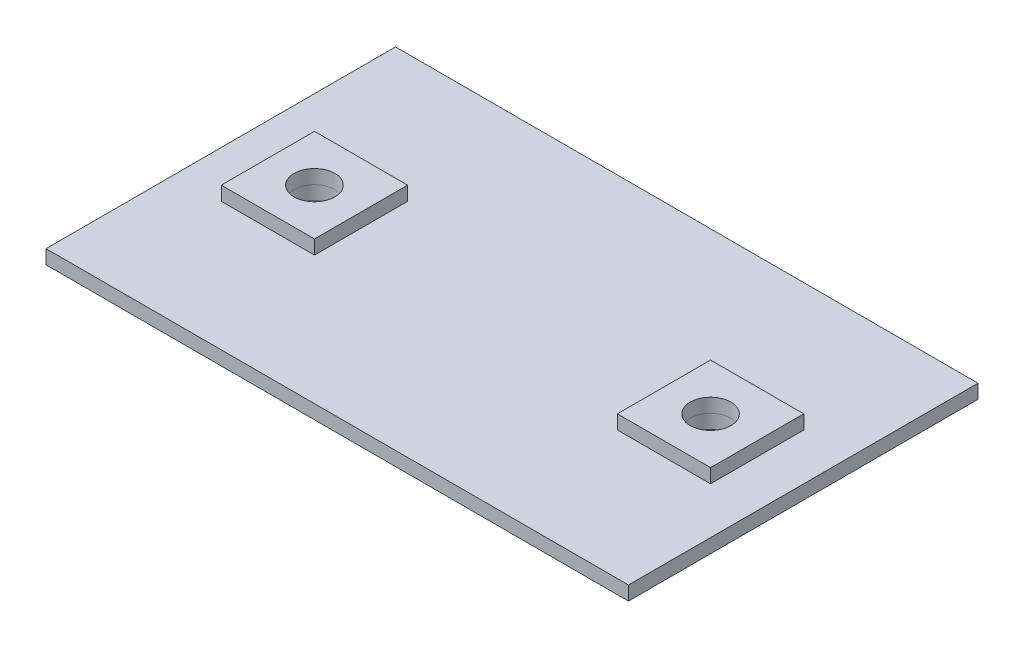
ISO-10303-21;
HEADER;
FILE_DESCRIPTION(('STEP AP214'),'2;1');
FILE_NAME('part.step','',(''),(''),'','','');
FILE_SCHEMA(('AUTOMOTIVE_DESIGN { 1 0 10303 214 1 1 1 1 }'));
ENDSEC;
DATA;
#1=APPLICATION_CONTEXT('core data for automotive mechanical design processes');
#2=APPLICATION_PROTOCOL_DEFINITION('international standard','automotive_design',2000,#1);
#3=PRODUCT_CONTEXT('',#1,'mechanical');
#4=PRODUCT('Part','Part','',(#3));
#5=PRODUCT_RELATED_PRODUCT_CATEGORY('part','',(#4));
#6=PRODUCT_DEFINITION_FORMATION('','',#4);
#7=PRODUCT_DEFINITION_CONTEXT('part definition',#1,'design');
#8=PRODUCT_DEFINITION('design','',#6,#7);
#9=PRODUCT_DEFINITION_SHAPE('','',#8);
#10=(LENGTH_UNIT() NAMED_UNIT(*) SI_UNIT(.MILLI.,.METRE.));
#11=(NAMED_UNIT(*) PLANE_ANGLE_UNIT() SI_UNIT($,.RADIAN.));
#12=(NAMED_UNIT(*) SI_UNIT($,.STERADIAN.) SOLID_ANGLE_UNIT());
#13=UNCERTAINTY_MEASURE_WITH_UNIT(LENGTH_MEASURE(1.E-05),#10,'distance_accuracy_value','');
#14=(GEOMETRIC_REPRESENTATION_CONTEXT(3) GLOBAL_UNCERTAINTY_ASSIGNED_CONTEXT((#13)) GLOBAL_UNIT_ASSIGNED_CONTEXT((#10,
#11,#12)) REPRESENTATION_CONTEXT('',''));
#15=CARTESIAN_POINT('',(0.,0.,0.));
#16=DIRECTION('',(0.,0.,1.));
#17=DIRECTION('',(1.,0.,0.));
#18=AXIS2_PLACEMENT_3D('',#15,#16,#17);
#19=CARTESIAN_POINT('',(85.,12.,-0.220000000000026));
#20=DIRECTION('',(0.,-1.,0.));
#21=DIRECTION('',(0.,0.,-1.));
#22=AXIS2_PLACEMENT_3D('',#19,#20,#21);
#23=PLANE('',#22);
#24=DIRECTION('',(0.,0.,-1.));
#25=VECTOR('',#24,1.);
#26=CARTESIAN_POINT('',(105.,12.,19.78));
#27=LINE('',#26,#25);
#28=CARTESIAN_POINT('',(105.,12.,19.78));
#29=VERTEX_POINT('',#28);
#30=CARTESIAN_POINT('',(105.,12.,-20.22));
#31=VERTEX_POINT('',#30);
#32=EDGE_CURVE('E104',#29,#31,#27,.T.);
#33=ORIENTED_EDGE('',*,*,#32,.T.);
#34=DIRECTION('',(-1.,0.,0.));
#35=VECTOR('',#34,1.);
#36=CARTESIAN_POINT('',(65.,12.,-20.22));
#37=LINE('',#36,#35);
#38=CARTESIAN_POINT('',(65.,12.,-20.22));
#39=VERTEX_POINT('',#38);
#40=EDGE_CURVE('E99',#31,#39,#37,.T.);
#41=ORIENTED_EDGE('',*,*,#40,.T.);
#42=DIRECTION('',(0.,0.,1.));
#43=VECTOR('',#42,1.);
#44=CARTESIAN_POINT('',(65.,12.,19.78));
#45=LINE('',#44,#43);
#46=CARTESIAN_POINT('',(65.,12.,19.78));
#47=VERTEX_POINT('',#46);
#48=EDGE_CURVE('E102',#39,#47,#45,.T.);
#49=ORIENTED_EDGE('',*,*,#48,.T.);
#50=DIRECTION('',(1.,0.,0.));
#51=VECTOR('',#50,1.);
#52=CARTESIAN_POINT('',(65.,12.,19.78));
#53=LINE('',#52,#51);
#54=EDGE_CURVE('E69',#47,#29,#53,.T.);
#55=ORIENTED_EDGE('',*,*,#54,.T.);
#56=EDGE_LOOP('',(#33,#41,#49,#55));
#57=FACE_BOUND('',#56,.T.);
#58=CARTESIAN_POINT('',(85.,12.,-0.220000000000026));
#59=DIRECTION('',(0.,1.,0.));
#60=DIRECTION('',(0.,0.,1.));
#61=AXIS2_PLACEMENT_3D('',#58,#59,#60);
#62=CIRCLE('',#61,8.75);
#63=CARTESIAN_POINT('',(85.,12.,8.52999999999998));
#64=VERTEX_POINT('',#63);
#65=EDGE_CURVE('E119',#64,#64,#62,.T.);
#66=ORIENTED_EDGE('',*,*,#65,.F.);
#67=EDGE_LOOP('',(#66));
#68=FACE_BOUND('',#67,.T.);
#69=ADVANCED_FACE('F52',(#57,#68),#23,.F.);
#70=CARTESIAN_POINT('',(85.,6.00000000000001,-0.220000000000026));
#71=DIRECTION('',(0.,-1.,0.));
#72=DIRECTION('',(0.,0.,-1.));
#73=AXIS2_PLACEMENT_3D('',#70,#71,#72);
#74=PLANE('',#73);
#75=DIRECTION('',(0.,0.,-1.));
#76=VECTOR('',#75,1.);
#77=CARTESIAN_POINT('',(105.,6.00000000000001,19.78));
#78=LINE('',#77,#76);
#79=CARTESIAN_POINT('',(105.,6.00000000000001,19.78));
#80=VERTEX_POINT('',#79);
#81=CARTESIAN_POINT('',(105.,6.00000000000001,-20.22));
#82=VERTEX_POINT('',#81);
#83=EDGE_CURVE('E116',#80,#82,#78,.T.);
#84=ORIENTED_EDGE('',*,*,#83,.F.);
#85=DIRECTION('',(1.,0.,0.));
#86=VECTOR('',#85,1.);
#87=CARTESIAN_POINT('',(65.,6.00000000000001,19.78));
#88=LINE('',#87,#86);
#89=CARTESIAN_POINT('',(65.,6.00000000000001,19.78));
#90=VERTEX_POINT('',#89);
#91=EDGE_CURVE('E92',#90,#80,#88,.T.);
#92=ORIENTED_EDGE('',*,*,#91,.F.);
#93=DIRECTION('',(0.,0.,1.));
#94=VECTOR('',#93,1.);
#95=CARTESIAN_POINT('',(65.,6.00000000000001,19.78));
#96=LINE('',#95,#94);
#97=CARTESIAN_POINT('',(65.,6.00000000000001,-20.22));
#98=VERTEX_POINT('',#97);
#99=EDGE_CURVE('E86',#98,#90,#96,.T.);
#100=ORIENTED_EDGE('',*,*,#99,.F.);
#101=DIRECTION('',(-1.,0.,0.));
#102=VECTOR('',#101,1.);
#103=CARTESIAN_POINT('',(65.,6.00000000000001,-20.22));
#104=LINE('',#103,#102);
#105=EDGE_CURVE('E108',#82,#98,#104,.T.);
#106=ORIENTED_EDGE('',*,*,#105,.F.);
#107=EDGE_LOOP('',(#84,#92,#100,#106));
#108=FACE_BOUND('',#107,.T.);
#109=CARTESIAN_POINT('',(85.,6.00000000000001,-0.220000000000026));
#110=DIRECTION('',(0.,1.,0.));
#111=DIRECTION('',(0.,0.,1.));
#112=AXIS2_PLACEMENT_3D('',#109,#110,#111);
#113=CIRCLE('',#112,8.75);
#114=CARTESIAN_POINT('',(85.,6.00000000000001,8.52999999999998));
#115=VERTEX_POINT('',#114);
#116=EDGE_CURVE('E131',#115,#115,#113,.T.);
#117=ORIENTED_EDGE('',*,*,#116,.T.);
#118=EDGE_LOOP('',(#117));
#119=FACE_BOUND('',#118,.T.);
#120=ADVANCED_FACE('F127',(#108,#119),#74,.T.);
#121=CARTESIAN_POINT('',(105.,12.,19.78));
#122=DIRECTION('',(-1.,0.,0.));
#123=DIRECTION('',(0.,0.,1.));
#124=AXIS2_PLACEMENT_3D('',#121,#122,#123);
#125=PLANE('',#124);
#126=ORIENTED_EDGE('',*,*,#83,.T.);
#127=DIRECTION('',(0.,-1.,0.));
#128=VECTOR('',#127,1.);
#129=CARTESIAN_POINT('',(105.,12.,-20.22));
#130=LINE('',#129,#128);
#131=EDGE_CURVE('E12',#31,#82,#130,.T.);
#132=ORIENTED_EDGE('',*,*,#131,.F.);
#133=ORIENTED_EDGE('',*,*,#32,.F.);
#134=DIRECTION('',(0.,-1.,0.));
#135=VECTOR('',#134,1.);
#136=CARTESIAN_POINT('',(105.,12.,19.78));
#137=LINE('',#136,#135);
#138=EDGE_CURVE('E112',#29,#80,#137,.T.);
#139=ORIENTED_EDGE('',*,*,#138,.T.);
#140=EDGE_LOOP('',(#126,#132,#133,#139));
#141=FACE_BOUND('',#140,.T.);
#142=ADVANCED_FACE('F54',(#141),#125,.F.);
#143=CARTESIAN_POINT('',(65.,12.,-20.22));
#144=DIRECTION('',(0.,0.,1.));
#145=DIRECTION('',(1.,0.,0.));
#146=AXIS2_PLACEMENT_3D('',#143,#144,#145);
#147=PLANE('',#146);
#148=ORIENTED_EDGE('',*,*,#105,.T.);
#149=DIRECTION('',(0.,-1.,0.));
#150=VECTOR('',#149,1.);
#151=CARTESIAN_POINT('',(65.,12.,-20.22));
#152=LINE('',#151,#150);
#153=EDGE_CURVE('E61',#39,#98,#152,.T.);
#154=ORIENTED_EDGE('',*,*,#153,.F.);
#155=ORIENTED_EDGE('',*,*,#40,.F.);
#156=ORIENTED_EDGE('',*,*,#131,.T.);
#157=EDGE_LOOP('',(#148,#154,#155,#156));
#158=FACE_BOUND('',#157,.T.);
#159=ADVANCED_FACE('F107',(#158),#147,.F.);
#160=CARTESIAN_POINT('',(65.,12.,19.78));
#161=DIRECTION('',(1.,0.,0.));
#162=DIRECTION('',(0.,0.,-1.));
#163=AXIS2_PLACEMENT_3D('',#160,#161,#162);
#164=PLANE('',#163);
#165=ORIENTED_EDGE('',*,*,#99,.T.);
#166=DIRECTION('',(0.,-1.,0.));
#167=VECTOR('',#166,1.);
#168=CARTESIAN_POINT('',(65.,12.,19.78));
#169=LINE('',#168,#167);
#170=EDGE_CURVE('E109',#47,#90,#169,.T.);
#171=ORIENTED_EDGE('',*,*,#170,.F.);
#172=ORIENTED_EDGE('',*,*,#48,.F.);
#173=ORIENTED_EDGE('',*,*,#153,.T.);
#174=EDGE_LOOP('',(#165,#171,#172,#173));
#175=FACE_BOUND('',#174,.T.);
#176=ADVANCED_FACE('F110',(#175),#164,.F.);
#177=CARTESIAN_POINT('',(65.,12.,19.78));
#178=DIRECTION('',(0.,0.,-1.));
#179=DIRECTION('',(-1.,0.,0.));
#180=AXIS2_PLACEMENT_3D('',#177,#178,#179);
#181=PLANE('',#180);
#182=ORIENTED_EDGE('',*,*,#91,.T.);
#183=ORIENTED_EDGE('',*,*,#138,.F.);
#184=ORIENTED_EDGE('',*,*,#54,.F.);
#185=ORIENTED_EDGE('',*,*,#170,.T.);
#186=EDGE_LOOP('',(#182,#183,#184,#185));
#187=FACE_BOUND('',#186,.T.);
#188=ADVANCED_FACE('F124',(#187),#181,.F.);
#189=CARTESIAN_POINT('',(85.,12.,-0.220000000000026));
#190=DIRECTION('',(0.,-1.,0.));
#191=DIRECTION('',(0.,0.,-1.));
#192=AXIS2_PLACEMENT_3D('',#189,#190,#191);
#193=CYLINDRICAL_SURFACE('',#192,8.75);
#194=ORIENTED_EDGE('',*,*,#65,.T.);
#195=EDGE_LOOP('',(#194));
#196=FACE_BOUND('',#195,.T.);
#197=ORIENTED_EDGE('',*,*,#116,.F.);
#198=EDGE_LOOP('',(#197));
#199=FACE_BOUND('',#198,.T.);
#200=ADVANCED_FACE('F137',(#196,#199),#193,.F.);
#201=CLOSED_SHELL('',(#69,#120,#142,#159,#176,#188,#200));
#202=MANIFOLD_SOLID_BREP('B2',#201);
#203=CARTESIAN_POINT('',(-85.,12.,-0.220000000000005));
#204=DIRECTION('',(0.,-1.,0.));
#205=DIRECTION('',(0.,0.,-1.));
#206=AXIS2_PLACEMENT_3D('',#203,#204,#205);
#207=PLANE('',#206);
#208=DIRECTION('',(0.,0.,-1.));
#209=VECTOR('',#208,1.);
#210=CARTESIAN_POINT('',(-65.,12.,19.78));
#211=LINE('',#210,#209);
#212=CARTESIAN_POINT('',(-65.,12.,19.78));
#213=VERTEX_POINT('',#212);
#214=CARTESIAN_POINT('',(-65.,12.,-20.22));
#215=VERTEX_POINT('',#214);
#216=EDGE_CURVE('E258',#213,#215,#211,.T.);
#217=ORIENTED_EDGE('',*,*,#216,.T.);
#218=DIRECTION('',(-1.,0.,0.));
#219=VECTOR('',#218,1.);
#220=CARTESIAN_POINT('',(-105.,12.,-20.22));
#221=LINE('',#220,#219);
#222=CARTESIAN_POINT('',(-105.,12.,-20.22));
#223=VERTEX_POINT('',#222);
#224=EDGE_CURVE('E253',#215,#223,#221,.T.);
#225=ORIENTED_EDGE('',*,*,#224,.T.);
#226=DIRECTION('',(0.,0.,1.));
#227=VECTOR('',#226,1.);
#228=CARTESIAN_POINT('',(-105.,12.,19.78));
#229=LINE('',#228,#227);
#230=CARTESIAN_POINT('',(-105.,12.,19.78));
#231=VERTEX_POINT('',#230);
#232=EDGE_CURVE('E256',#223,#231,#229,.T.);
#233=ORIENTED_EDGE('',*,*,#232,.T.);
#234=DIRECTION('',(1.,0.,0.));
#235=VECTOR('',#234,1.);
#236=CARTESIAN_POINT('',(-105.,12.,19.78));
#237=LINE('',#236,#235);
#238=EDGE_CURVE('E223',#231,#213,#237,.T.);
#239=ORIENTED_EDGE('',*,*,#238,.T.);
#240=EDGE_LOOP('',(#217,#225,#233,#239));
#241=FACE_BOUND('',#240,.T.);
#242=CARTESIAN_POINT('',(-85.,12.,-0.219999999999998));
#243=DIRECTION('',(0.,1.,0.));
#244=DIRECTION('',(0.,0.,1.));
#245=AXIS2_PLACEMENT_3D('',#242,#243,#244);
#246=CIRCLE('',#245,8.75);
#247=CARTESIAN_POINT('',(-85.,12.,8.53));
#248=VERTEX_POINT('',#247);
#249=EDGE_CURVE('E273',#248,#248,#246,.T.);
#250=ORIENTED_EDGE('',*,*,#249,.F.);
#251=EDGE_LOOP('',(#250));
#252=FACE_BOUND('',#251,.T.);
#253=ADVANCED_FACE('F206',(#241,#252),#207,.F.);
#254=CARTESIAN_POINT('',(-85.,6.00000000000001,-0.220000000000005));
#255=DIRECTION('',(0.,-1.,0.));
#256=DIRECTION('',(0.,0.,-1.));
#257=AXIS2_PLACEMENT_3D('',#254,#255,#256);
#258=PLANE('',#257);
#259=DIRECTION('',(0.,0.,-1.));
#260=VECTOR('',#259,1.);
#261=CARTESIAN_POINT('',(-65.,6.00000000000001,19.78));
#262=LINE('',#261,#260);
#263=CARTESIAN_POINT('',(-65.,6.00000000000001,19.78));
#264=VERTEX_POINT('',#263);
#265=CARTESIAN_POINT('',(-65.,6.00000000000001,-20.22));
#266=VERTEX_POINT('',#265);
#267=EDGE_CURVE('E270',#264,#266,#262,.T.);
#268=ORIENTED_EDGE('',*,*,#267,.F.);
#269=DIRECTION('',(1.,0.,0.));
#270=VECTOR('',#269,1.);
#271=CARTESIAN_POINT('',(-105.,6.00000000000001,19.78));
#272=LINE('',#271,#270);
#273=CARTESIAN_POINT('',(-105.,6.00000000000001,19.78));
#274=VERTEX_POINT('',#273);
#275=EDGE_CURVE('E246',#274,#264,#272,.T.);
#276=ORIENTED_EDGE('',*,*,#275,.F.);
#277=DIRECTION('',(0.,0.,1.));
#278=VECTOR('',#277,1.);
#279=CARTESIAN_POINT('',(-105.,6.00000000000001,19.78));
#280=LINE('',#279,#278);
#281=CARTESIAN_POINT('',(-105.,6.00000000000001,-20.22));
#282=VERTEX_POINT('',#281);
#283=EDGE_CURVE('E240',#282,#274,#280,.T.);
#284=ORIENTED_EDGE('',*,*,#283,.F.);
#285=DIRECTION('',(-1.,0.,0.));
#286=VECTOR('',#285,1.);
#287=CARTESIAN_POINT('',(-105.,6.00000000000001,-20.22));
#288=LINE('',#287,#286);
#289=EDGE_CURVE('E262',#266,#282,#288,.T.);
#290=ORIENTED_EDGE('',*,*,#289,.F.);
#291=EDGE_LOOP('',(#268,#276,#284,#290));
#292=FACE_BOUND('',#291,.T.);
#293=CARTESIAN_POINT('',(-85.,6.00000000000001,-0.219999999999998));
#294=DIRECTION('',(0.,1.,0.));
#295=DIRECTION('',(0.,0.,1.));
#296=AXIS2_PLACEMENT_3D('',#293,#294,#295);
#297=CIRCLE('',#296,8.75);
#298=CARTESIAN_POINT('',(-85.,6.00000000000001,8.53));
#299=VERTEX_POINT('',#298);
#300=EDGE_CURVE('E285',#299,#299,#297,.T.);
#301=ORIENTED_EDGE('',*,*,#300,.T.);
#302=EDGE_LOOP('',(#301));
#303=FACE_BOUND('',#302,.T.);
#304=ADVANCED_FACE('F281',(#292,#303),#258,.T.);
#305=CARTESIAN_POINT('',(-65.,12.,19.78));
#306=DIRECTION('',(-1.,0.,0.));
#307=DIRECTION('',(0.,0.,1.));
#308=AXIS2_PLACEMENT_3D('',#305,#306,#307);
#309=PLANE('',#308);
#310=ORIENTED_EDGE('',*,*,#267,.T.);
#311=DIRECTION('',(0.,-1.,0.));
#312=VECTOR('',#311,1.);
#313=CARTESIAN_POINT('',(-65.,12.,-20.22));
#314=LINE('',#313,#312);
#315=EDGE_CURVE('E50',#215,#266,#314,.T.);
#316=ORIENTED_EDGE('',*,*,#315,.F.);
#317=ORIENTED_EDGE('',*,*,#216,.F.);
#318=DIRECTION('',(0.,-1.,0.));
#319=VECTOR('',#318,1.);
#320=CARTESIAN_POINT('',(-65.,12.,19.78));
#321=LINE('',#320,#319);
#322=EDGE_CURVE('E266',#213,#264,#321,.T.);
#323=ORIENTED_EDGE('',*,*,#322,.T.);
#324=EDGE_LOOP('',(#310,#316,#317,#323));
#325=FACE_BOUND('',#324,.T.);
#326=ADVANCED_FACE('F208',(#325),#309,.F.);
#327=CARTESIAN_POINT('',(-105.,12.,-20.22));
#328=DIRECTION('',(0.,0.,1.));
#329=DIRECTION('',(1.,0.,0.));
#330=AXIS2_PLACEMENT_3D('',#327,#328,#329);
#331=PLANE('',#330);
#332=ORIENTED_EDGE('',*,*,#289,.T.);
#333=DIRECTION('',(0.,-1.,0.));
#334=VECTOR('',#333,1.);
#335=CARTESIAN_POINT('',(-105.,12.,-20.22));
#336=LINE('',#335,#334);
#337=EDGE_CURVE('E215',#223,#282,#336,.T.);
#338=ORIENTED_EDGE('',*,*,#337,.F.);
#339=ORIENTED_EDGE('',*,*,#224,.F.);
#340=ORIENTED_EDGE('',*,*,#315,.T.);
#341=EDGE_LOOP('',(#332,#338,#339,#340));
#342=FACE_BOUND('',#341,.T.);
#343=ADVANCED_FACE('F261',(#342),#331,.F.);
#344=CARTESIAN_POINT('',(-105.,12.,19.78));
#345=DIRECTION('',(1.,0.,0.));
#346=DIRECTION('',(0.,0.,-1.));
#347=AXIS2_PLACEMENT_3D('',#344,#345,#346);
#348=PLANE('',#347);
#349=ORIENTED_EDGE('',*,*,#283,.T.);
#350=DIRECTION('',(0.,-1.,0.));
#351=VECTOR('',#350,1.);
#352=CARTESIAN_POINT('',(-105.,12.,19.78));
#353=LINE('',#352,#351);
#354=EDGE_CURVE('E263',#231,#274,#353,.T.);
#355=ORIENTED_EDGE('',*,*,#354,.F.);
#356=ORIENTED_EDGE('',*,*,#232,.F.);
#357=ORIENTED_EDGE('',*,*,#337,.T.);
#358=EDGE_LOOP('',(#349,#355,#356,#357));
#359=FACE_BOUND('',#358,.T.);
#360=ADVANCED_FACE('F264',(#359),#348,.F.);
#361=CARTESIAN_POINT('',(-105.,12.,19.78));
#362=DIRECTION('',(0.,0.,-1.));
#363=DIRECTION('',(-1.,0.,0.));
#364=AXIS2_PLACEMENT_3D('',#361,#362,#363);
#365=PLANE('',#364);
#366=ORIENTED_EDGE('',*,*,#275,.T.);
#367=ORIENTED_EDGE('',*,*,#322,.F.);
#368=ORIENTED_EDGE('',*,*,#238,.F.);
#369=ORIENTED_EDGE('',*,*,#354,.T.);
#370=EDGE_LOOP('',(#366,#367,#368,#369));
#371=FACE_BOUND('',#370,.T.);
#372=ADVANCED_FACE('F278',(#371),#365,.F.);
#373=CARTESIAN_POINT('',(-85.,12.,-0.219999999999998));
#374=DIRECTION('',(0.,-1.,0.));
#375=DIRECTION('',(0.,0.,-1.));
#376=AXIS2_PLACEMENT_3D('',#373,#374,#375);
#377=CYLINDRICAL_SURFACE('',#376,8.75);
#378=ORIENTED_EDGE('',*,*,#249,.T.);
#379=EDGE_LOOP('',(#378));
#380=FACE_BOUND('',#379,.T.);
#381=ORIENTED_EDGE('',*,*,#300,.F.);
#382=EDGE_LOOP('',(#381));
#383=FACE_BOUND('',#382,.T.);
#384=ADVANCED_FACE('F291',(#380,#383),#377,.F.);
#385=CLOSED_SHELL('',(#253,#304,#326,#343,#360,#372,#384));
#386=MANIFOLD_SOLID_BREP('B6',#385);
#387=CARTESIAN_POINT('',(-125.,6.,0.));
#388=DIRECTION('',(-1.,0.,0.));
#389=DIRECTION('',(0.,0.,1.));
#390=AXIS2_PLACEMENT_3D('',#387,#388,#389);
#391=PLANE('',#390);
#392=DIRECTION('',(0.,0.,-1.));
#393=VECTOR('',#392,1.);
#394=CARTESIAN_POINT('',(-125.,0.,0.));
#395=LINE('',#394,#393);
#396=CARTESIAN_POINT('',(-125.,0.,75.));
#397=VERTEX_POINT('',#396);
#398=CARTESIAN_POINT('',(-125.,0.,-75.));
#399=VERTEX_POINT('',#398);
#400=EDGE_CURVE('E413',#397,#399,#395,.T.);
#401=ORIENTED_EDGE('',*,*,#400,.F.);
#402=DIRECTION('',(0.,-1.,0.));
#403=VECTOR('',#402,1.);
#404=CARTESIAN_POINT('',(-125.,6.,75.));
#405=LINE('',#404,#403);
#406=CARTESIAN_POINT('',(-125.,6.,75.));
#407=VERTEX_POINT('',#406);
#408=EDGE_CURVE('E204',#407,#397,#405,.T.);
#409=ORIENTED_EDGE('',*,*,#408,.F.);
#410=DIRECTION('',(0.,0.,-1.));
#411=VECTOR('',#410,1.);
#412=CARTESIAN_POINT('',(-125.,6.,0.));
#413=LINE('',#412,#411);
#414=CARTESIAN_POINT('',(-125.,6.,-75.));
#415=VERTEX_POINT('',#414);
#416=EDGE_CURVE('E393',#407,#415,#413,.T.);
#417=ORIENTED_EDGE('',*,*,#416,.T.);
#418=DIRECTION('',(0.,-1.,0.));
#419=VECTOR('',#418,1.);
#420=CARTESIAN_POINT('',(-125.,6.,-75.));
#421=LINE('',#420,#419);
#422=EDGE_CURVE('E354',#415,#399,#421,.T.);
#423=ORIENTED_EDGE('',*,*,#422,.T.);
#424=EDGE_LOOP('',(#401,#409,#417,#423));
#425=FACE_BOUND('',#424,.T.);
#426=ADVANCED_FACE('F337',(#425),#391,.T.);
#427=CARTESIAN_POINT('',(0.,6.,75.));
#428=DIRECTION('',(0.,0.,-1.));
#429=DIRECTION('',(-1.,0.,0.));
#430=AXIS2_PLACEMENT_3D('',#427,#428,#429);
#431=PLANE('',#430);
#432=DIRECTION('',(1.,0.,0.));
#433=VECTOR('',#432,1.);
#434=CARTESIAN_POINT('',(0.,0.,75.));
#435=LINE('',#434,#433);
#436=CARTESIAN_POINT('',(125.,0.,75.));
#437=VERTEX_POINT('',#436);
#438=EDGE_CURVE('E398',#397,#437,#435,.T.);
#439=ORIENTED_EDGE('',*,*,#438,.T.);
#440=DIRECTION('',(0.,-1.,0.));
#441=VECTOR('',#440,1.);
#442=CARTESIAN_POINT('',(125.,6.,75.));
#443=LINE('',#442,#441);
#444=CARTESIAN_POINT('',(125.,6.,75.));
#445=VERTEX_POINT('',#444);
#446=EDGE_CURVE('E346',#445,#437,#443,.T.);
#447=ORIENTED_EDGE('',*,*,#446,.F.);
#448=DIRECTION('',(1.,0.,0.));
#449=VECTOR('',#448,1.);
#450=CARTESIAN_POINT('',(0.,6.,75.));
#451=LINE('',#450,#449);
#452=EDGE_CURVE('E388',#407,#445,#451,.T.);
#453=ORIENTED_EDGE('',*,*,#452,.F.);
#454=ORIENTED_EDGE('',*,*,#408,.T.);
#455=EDGE_LOOP('',(#439,#447,#453,#454));
#456=FACE_BOUND('',#455,.T.);
#457=ADVANCED_FACE('F396',(#456),#431,.F.);
#458=CARTESIAN_POINT('',(125.,6.,0.));
#459=DIRECTION('',(-1.,0.,0.));
#460=DIRECTION('',(0.,0.,1.));
#461=AXIS2_PLACEMENT_3D('',#458,#459,#460);
#462=PLANE('',#461);
#463=DIRECTION('',(0.,0.,-1.));
#464=VECTOR('',#463,1.);
#465=CARTESIAN_POINT('',(125.,0.,0.));
#466=LINE('',#465,#464);
#467=CARTESIAN_POINT('',(125.,0.,-75.));
#468=VERTEX_POINT('',#467);
#469=EDGE_CURVE('E410',#437,#468,#466,.T.);
#470=ORIENTED_EDGE('',*,*,#469,.T.);
#471=DIRECTION('',(0.,-1.,0.));
#472=VECTOR('',#471,1.);
#473=CARTESIAN_POINT('',(125.,6.,-75.));
#474=LINE('',#473,#472);
#475=CARTESIAN_POINT('',(125.,6.,-75.));
#476=VERTEX_POINT('',#475);
#477=EDGE_CURVE('E368',#476,#468,#474,.T.);
#478=ORIENTED_EDGE('',*,*,#477,.F.);
#479=DIRECTION('',(0.,0.,-1.));
#480=VECTOR('',#479,1.);
#481=CARTESIAN_POINT('',(125.,6.,0.));
#482=LINE('',#481,#480);
#483=EDGE_CURVE('E380',#445,#476,#482,.T.);
#484=ORIENTED_EDGE('',*,*,#483,.F.);
#485=ORIENTED_EDGE('',*,*,#446,.T.);
#486=EDGE_LOOP('',(#470,#478,#484,#485));
#487=FACE_BOUND('',#486,.T.);
#488=ADVANCED_FACE('F382',(#487),#462,.F.);
#489=CARTESIAN_POINT('',(0.,6.,-75.));
#490=DIRECTION('',(0.,0.,-1.));
#491=DIRECTION('',(-1.,0.,0.));
#492=AXIS2_PLACEMENT_3D('',#489,#490,#491);
#493=PLANE('',#492);
#494=DIRECTION('',(1.,0.,0.));
#495=VECTOR('',#494,1.);
#496=CARTESIAN_POINT('',(0.,0.,-75.));
#497=LINE('',#496,#495);
#498=EDGE_CURVE('E407',#399,#468,#497,.T.);
#499=ORIENTED_EDGE('',*,*,#498,.F.);
#500=ORIENTED_EDGE('',*,*,#422,.F.);
#501=DIRECTION('',(1.,0.,0.));
#502=VECTOR('',#501,1.);
#503=CARTESIAN_POINT('',(0.,6.,-75.));
#504=LINE('',#503,#502);
#505=EDGE_CURVE('E387',#415,#476,#504,.T.);
#506=ORIENTED_EDGE('',*,*,#505,.T.);
#507=ORIENTED_EDGE('',*,*,#477,.T.);
#508=EDGE_LOOP('',(#499,#500,#506,#507));
#509=FACE_BOUND('',#508,.T.);
#510=ADVANCED_FACE('F447',(#509),#493,.T.);
#511=CARTESIAN_POINT('',(85.,6.,-0.220000000000029));
#512=DIRECTION('',(0.,-1.,0.));
#513=DIRECTION('',(0.,0.,-1.));
#514=AXIS2_PLACEMENT_3D('',#511,#512,#513);
#515=CYLINDRICAL_SURFACE('',#514,8.75000000000001);
#516=CARTESIAN_POINT('',(85.,6.,-0.220000000000029));
#517=DIRECTION('',(0.,1.,0.));
#518=DIRECTION('',(0.,0.,1.));
#519=AXIS2_PLACEMENT_3D('',#516,#517,#518);
#520=CIRCLE('',#519,8.75000000000001);
#521=CARTESIAN_POINT('',(85.,6.,8.52999999999998));
#522=VERTEX_POINT('',#521);
#523=EDGE_CURVE('E406',#522,#522,#520,.T.);
#524=ORIENTED_EDGE('',*,*,#523,.T.);
#525=EDGE_LOOP('',(#524));
#526=FACE_BOUND('',#525,.T.);
#527=CARTESIAN_POINT('',(85.,0.,-0.220000000000029));
#528=DIRECTION('',(0.,1.,0.));
#529=DIRECTION('',(0.,0.,1.));
#530=AXIS2_PLACEMENT_3D('',#527,#528,#529);
#531=CIRCLE('',#530,8.75000000000001);
#532=CARTESIAN_POINT('',(85.,0.,8.52999999999998));
#533=VERTEX_POINT('',#532);
#534=EDGE_CURVE('E415',#533,#533,#531,.T.);
#535=ORIENTED_EDGE('',*,*,#534,.F.);
#536=EDGE_LOOP('',(#535));
#537=FACE_BOUND('',#536,.T.);
#538=ADVANCED_FACE('F339',(#526,#537),#515,.F.);
#539=CARTESIAN_POINT('',(-85.,6.,-0.219999999999998));
#540=DIRECTION('',(0.,-1.,0.));
#541=DIRECTION('',(0.,0.,-1.));
#542=AXIS2_PLACEMENT_3D('',#539,#540,#541);
#543=CYLINDRICAL_SURFACE('',#542,8.75000000000001);
#544=CARTESIAN_POINT('',(-85.,6.,-0.219999999999998));
#545=DIRECTION('',(0.,1.,0.));
#546=DIRECTION('',(0.,0.,1.));
#547=AXIS2_PLACEMENT_3D('',#544,#545,#546);
#548=CIRCLE('',#547,8.75000000000001);
#549=CARTESIAN_POINT('',(-85.,6.,8.53000000000001));
#550=VERTEX_POINT('',#549);
#551=EDGE_CURVE('E402',#550,#550,#548,.T.);
#552=ORIENTED_EDGE('',*,*,#551,.T.);
#553=EDGE_LOOP('',(#552));
#554=FACE_BOUND('',#553,.T.);
#555=CARTESIAN_POINT('',(-85.,0.,-0.219999999999998));
#556=DIRECTION('',(0.,1.,0.));
#557=DIRECTION('',(0.,0.,1.));
#558=AXIS2_PLACEMENT_3D('',#555,#556,#557);
#559=CIRCLE('',#558,8.75000000000001);
#560=CARTESIAN_POINT('',(-85.,0.,8.53000000000001));
#561=VERTEX_POINT('',#560);
#562=EDGE_CURVE('E403',#561,#561,#559,.T.);
#563=ORIENTED_EDGE('',*,*,#562,.F.);
#564=EDGE_LOOP('',(#563));
#565=FACE_BOUND('',#564,.T.);
#566=ADVANCED_FACE('F429',(#554,#565),#543,.F.);
#567=CARTESIAN_POINT('',(0.,6.,0.));
#568=DIRECTION('',(0.,1.,0.));
#569=DIRECTION('',(0.,0.,1.));
#570=AXIS2_PLACEMENT_3D('',#567,#568,#569);
#571=PLANE('',#570);
#572=ORIENTED_EDGE('',*,*,#523,.F.);
#573=EDGE_LOOP('',(#572));
#574=FACE_BOUND('',#573,.T.);
#575=ORIENTED_EDGE('',*,*,#416,.F.);
#576=ORIENTED_EDGE('',*,*,#452,.T.);
#577=ORIENTED_EDGE('',*,*,#483,.T.);
#578=ORIENTED_EDGE('',*,*,#505,.F.);
#579=EDGE_LOOP('',(#575,#576,#577,#578));
#580=FACE_BOUND('',#579,.T.);
#581=ORIENTED_EDGE('',*,*,#551,.F.);
#582=EDGE_LOOP('',(#581));
#583=FACE_BOUND('',#582,.T.);
#584=ADVANCED_FACE('F391',(#574,#580,#583),#571,.T.);
#585=CARTESIAN_POINT('',(0.,0.,0.));
#586=DIRECTION('',(0.,1.,0.));
#587=DIRECTION('',(0.,0.,1.));
#588=AXIS2_PLACEMENT_3D('',#585,#586,#587);
#589=PLANE('',#588);
#590=ORIENTED_EDGE('',*,*,#534,.T.);
#591=EDGE_LOOP('',(#590));
#592=FACE_BOUND('',#591,.T.);
#593=ORIENTED_EDGE('',*,*,#400,.T.);
#594=ORIENTED_EDGE('',*,*,#498,.T.);
#595=ORIENTED_EDGE('',*,*,#469,.F.);
#596=ORIENTED_EDGE('',*,*,#438,.F.);
#597=EDGE_LOOP('',(#593,#594,#595,#596));
#598=FACE_BOUND('',#597,.T.);
#599=ORIENTED_EDGE('',*,*,#562,.T.);
#600=EDGE_LOOP('',(#599));
#601=FACE_BOUND('',#600,.T.);
#602=ADVANCED_FACE('F428',(#592,#598,#601),#589,.F.);
#603=CLOSED_SHELL('',(#426,#457,#488,#510,#538,#566,#584,#602));
#604=MANIFOLD_SOLID_BREP('B44',#603);
#605=ADVANCED_BREP_SHAPE_REPRESENTATION('',(#18,#202,#386,#604),#14);
#606=SHAPE_DEFINITION_REPRESENTATION(#9,#605);
ENDSEC;
END-ISO-10303-21;
